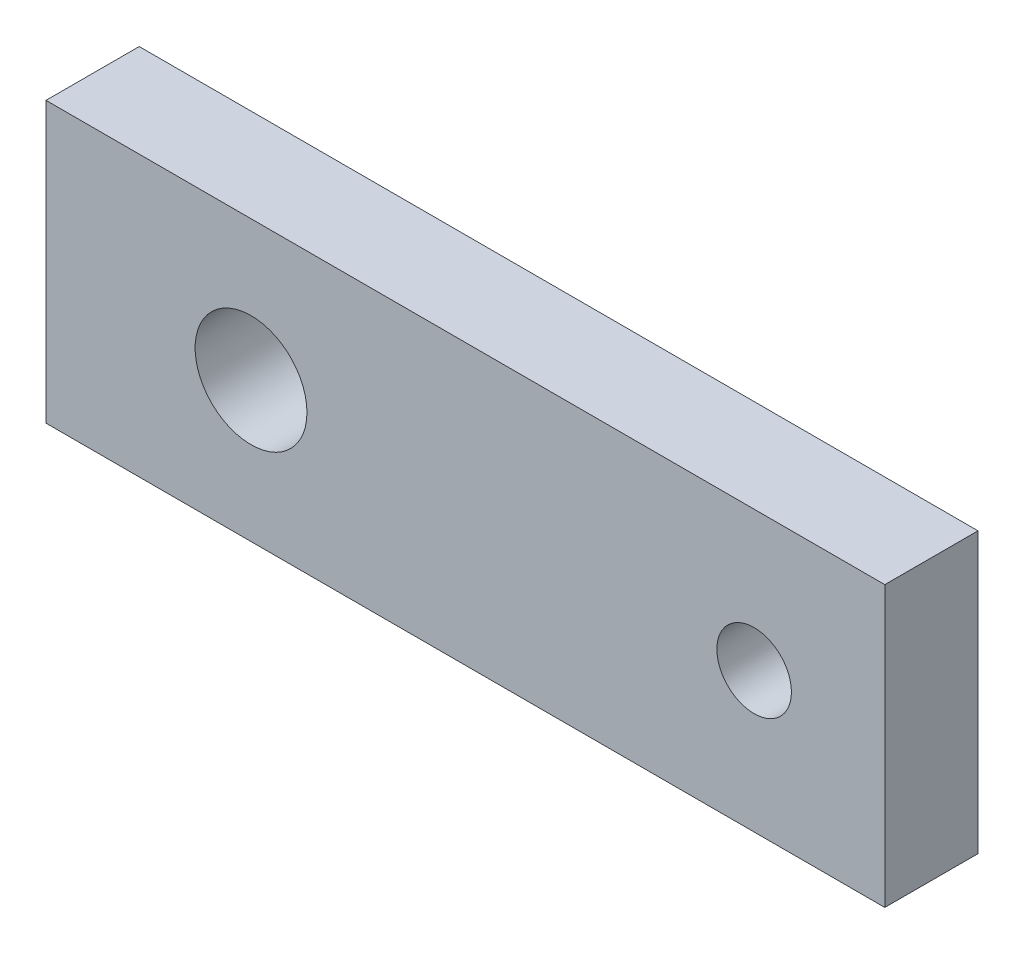
ISO-10303-21;
HEADER;
FILE_DESCRIPTION(('STEP AP214'),'2;1');
FILE_NAME('part.step','',(''),(''),'','','');
FILE_SCHEMA(('AUTOMOTIVE_DESIGN { 1 0 10303 214 1 1 1 1 }'));
ENDSEC;
DATA;
#1=APPLICATION_CONTEXT('core data for automotive mechanical design processes');
#2=APPLICATION_PROTOCOL_DEFINITION('international standard','automotive_design',2000,#1);
#3=PRODUCT_CONTEXT('',#1,'mechanical');
#4=PRODUCT('Part','Part','',(#3));
#5=PRODUCT_RELATED_PRODUCT_CATEGORY('part','',(#4));
#6=PRODUCT_DEFINITION_FORMATION('','',#4);
#7=PRODUCT_DEFINITION_CONTEXT('part definition',#1,'design');
#8=PRODUCT_DEFINITION('design','',#6,#7);
#9=PRODUCT_DEFINITION_SHAPE('','',#8);
#10=(LENGTH_UNIT() NAMED_UNIT(*) SI_UNIT(.MILLI.,.METRE.));
#11=(NAMED_UNIT(*) PLANE_ANGLE_UNIT() SI_UNIT($,.RADIAN.));
#12=(NAMED_UNIT(*) SI_UNIT($,.STERADIAN.) SOLID_ANGLE_UNIT());
#13=UNCERTAINTY_MEASURE_WITH_UNIT(LENGTH_MEASURE(1.E-05),#10,'distance_accuracy_value','');
#14=(GEOMETRIC_REPRESENTATION_CONTEXT(3) GLOBAL_UNCERTAINTY_ASSIGNED_CONTEXT((#13)) GLOBAL_UNIT_ASSIGNED_CONTEXT((#10,
#11,#12)) REPRESENTATION_CONTEXT('',''));
#15=CARTESIAN_POINT('',(0.,0.,0.));
#16=DIRECTION('',(0.,0.,1.));
#17=DIRECTION('',(1.,0.,0.));
#18=AXIS2_PLACEMENT_3D('',#15,#16,#17);
#19=CARTESIAN_POINT('',(0.,0.,10.));
#20=DIRECTION('',(0.,0.,-1.));
#21=DIRECTION('',(-1.,0.,0.));
#22=AXIS2_PLACEMENT_3D('',#19,#20,#21);
#23=PLANE('',#22);
#24=DIRECTION('',(0.,1.,0.));
#25=VECTOR('',#24,1.);
#26=CARTESIAN_POINT('',(45.,-15.,10.));
#27=LINE('',#26,#25);
#28=CARTESIAN_POINT('',(45.,-15.,10.));
#29=VERTEX_POINT('',#28);
#30=CARTESIAN_POINT('',(45.,15.,10.));
#31=VERTEX_POINT('',#30);
#32=EDGE_CURVE('E85',#29,#31,#27,.T.);
#33=ORIENTED_EDGE('',*,*,#32,.T.);
#34=DIRECTION('',(-1.,0.,0.));
#35=VECTOR('',#34,1.);
#36=CARTESIAN_POINT('',(-45.,15.,10.));
#37=LINE('',#36,#35);
#38=CARTESIAN_POINT('',(-45.,15.,10.));
#39=VERTEX_POINT('',#38);
#40=EDGE_CURVE('E80',#31,#39,#37,.T.);
#41=ORIENTED_EDGE('',*,*,#40,.T.);
#42=DIRECTION('',(0.,-1.,0.));
#43=VECTOR('',#42,1.);
#44=CARTESIAN_POINT('',(-45.,-15.,10.));
#45=LINE('',#44,#43);
#46=CARTESIAN_POINT('',(-45.,-15.,10.));
#47=VERTEX_POINT('',#46);
#48=EDGE_CURVE('E83',#39,#47,#45,.T.);
#49=ORIENTED_EDGE('',*,*,#48,.T.);
#50=DIRECTION('',(1.,0.,0.));
#51=VECTOR('',#50,1.);
#52=CARTESIAN_POINT('',(-45.,-15.,10.));
#53=LINE('',#52,#51);
#54=EDGE_CURVE('E50',#47,#29,#53,.T.);
#55=ORIENTED_EDGE('',*,*,#54,.T.);
#56=EDGE_LOOP('',(#33,#41,#49,#55));
#57=FACE_BOUND('',#56,.T.);
#58=CARTESIAN_POINT('',(-23.,0.,10.));
#59=DIRECTION('',(0.,0.,1.));
#60=DIRECTION('',(1.,0.,0.));
#61=AXIS2_PLACEMENT_3D('',#58,#59,#60);
#62=CIRCLE('',#61,6.);
#63=CARTESIAN_POINT('',(-17.,0.,10.));
#64=VERTEX_POINT('',#63);
#65=EDGE_CURVE('E100',#64,#64,#62,.T.);
#66=ORIENTED_EDGE('',*,*,#65,.F.);
#67=EDGE_LOOP('',(#66));
#68=FACE_BOUND('',#67,.T.);
#69=CARTESIAN_POINT('',(30.98,0.,10.));
#70=DIRECTION('',(0.,0.,1.));
#71=DIRECTION('',(1.,0.,0.));
#72=AXIS2_PLACEMENT_3D('',#69,#70,#71);
#73=CIRCLE('',#72,4.00000000000001);
#74=CARTESIAN_POINT('',(34.98,0.,10.));
#75=VERTEX_POINT('',#74);
#76=EDGE_CURVE('E115',#75,#75,#73,.T.);
#77=ORIENTED_EDGE('',*,*,#76,.F.);
#78=EDGE_LOOP('',(#77));
#79=FACE_BOUND('',#78,.T.);
#80=ADVANCED_FACE('F33',(#57,#68,#79),#23,.F.);
#81=CARTESIAN_POINT('',(0.,0.,0.));
#82=DIRECTION('',(0.,0.,-1.));
#83=DIRECTION('',(-1.,0.,0.));
#84=AXIS2_PLACEMENT_3D('',#81,#82,#83);
#85=PLANE('',#84);
#86=CARTESIAN_POINT('',(-23.,0.,0.));
#87=DIRECTION('',(0.,0.,1.));
#88=DIRECTION('',(1.,0.,0.));
#89=AXIS2_PLACEMENT_3D('',#86,#87,#88);
#90=CIRCLE('',#89,6.);
#91=CARTESIAN_POINT('',(-17.,0.,0.));
#92=VERTEX_POINT('',#91);
#93=EDGE_CURVE('E112',#92,#92,#90,.T.);
#94=ORIENTED_EDGE('',*,*,#93,.T.);
#95=EDGE_LOOP('',(#94));
#96=FACE_BOUND('',#95,.T.);
#97=DIRECTION('',(0.,1.,0.));
#98=VECTOR('',#97,1.);
#99=CARTESIAN_POINT('',(45.,-15.,0.));
#100=LINE('',#99,#98);
#101=CARTESIAN_POINT('',(45.,-15.,0.));
#102=VERTEX_POINT('',#101);
#103=CARTESIAN_POINT('',(45.,15.,0.));
#104=VERTEX_POINT('',#103);
#105=EDGE_CURVE('E97',#102,#104,#100,.T.);
#106=ORIENTED_EDGE('',*,*,#105,.F.);
#107=DIRECTION('',(1.,0.,0.));
#108=VECTOR('',#107,1.);
#109=CARTESIAN_POINT('',(-45.,-15.,0.));
#110=LINE('',#109,#108);
#111=CARTESIAN_POINT('',(-45.,-15.,0.));
#112=VERTEX_POINT('',#111);
#113=EDGE_CURVE('E73',#112,#102,#110,.T.);
#114=ORIENTED_EDGE('',*,*,#113,.F.);
#115=DIRECTION('',(0.,-1.,0.));
#116=VECTOR('',#115,1.);
#117=CARTESIAN_POINT('',(-45.,-15.,0.));
#118=LINE('',#117,#116);
#119=CARTESIAN_POINT('',(-45.,15.,0.));
#120=VERTEX_POINT('',#119);
#121=EDGE_CURVE('E67',#120,#112,#118,.T.);
#122=ORIENTED_EDGE('',*,*,#121,.F.);
#123=DIRECTION('',(-1.,0.,0.));
#124=VECTOR('',#123,1.);
#125=CARTESIAN_POINT('',(-45.,15.,0.));
#126=LINE('',#125,#124);
#127=EDGE_CURVE('E89',#104,#120,#126,.T.);
#128=ORIENTED_EDGE('',*,*,#127,.F.);
#129=EDGE_LOOP('',(#106,#114,#122,#128));
#130=FACE_BOUND('',#129,.T.);
#131=CARTESIAN_POINT('',(30.98,0.,0.));
#132=DIRECTION('',(0.,0.,1.));
#133=DIRECTION('',(1.,0.,0.));
#134=AXIS2_PLACEMENT_3D('',#131,#132,#133);
#135=CIRCLE('',#134,4.00000000000001);
#136=CARTESIAN_POINT('',(34.98,0.,0.));
#137=VERTEX_POINT('',#136);
#138=EDGE_CURVE('E118',#137,#137,#135,.T.);
#139=ORIENTED_EDGE('',*,*,#138,.T.);
#140=EDGE_LOOP('',(#139));
#141=FACE_BOUND('',#140,.T.);
#142=ADVANCED_FACE('F108',(#96,#130,#141),#85,.T.);
#143=CARTESIAN_POINT('',(45.,-15.,10.));
#144=DIRECTION('',(-1.,0.,0.));
#145=DIRECTION('',(0.,0.,1.));
#146=AXIS2_PLACEMENT_3D('',#143,#144,#145);
#147=PLANE('',#146);
#148=ORIENTED_EDGE('',*,*,#105,.T.);
#149=DIRECTION('',(0.,0.,-1.));
#150=VECTOR('',#149,1.);
#151=CARTESIAN_POINT('',(45.,15.,10.));
#152=LINE('',#151,#150);
#153=EDGE_CURVE('E11',#31,#104,#152,.T.);
#154=ORIENTED_EDGE('',*,*,#153,.F.);
#155=ORIENTED_EDGE('',*,*,#32,.F.);
#156=DIRECTION('',(0.,0.,-1.));
#157=VECTOR('',#156,1.);
#158=CARTESIAN_POINT('',(45.,-15.,10.));
#159=LINE('',#158,#157);
#160=EDGE_CURVE('E93',#29,#102,#159,.T.);
#161=ORIENTED_EDGE('',*,*,#160,.T.);
#162=EDGE_LOOP('',(#148,#154,#155,#161));
#163=FACE_BOUND('',#162,.T.);
#164=ADVANCED_FACE('F35',(#163),#147,.F.);
#165=CARTESIAN_POINT('',(-45.,15.,10.));
#166=DIRECTION('',(0.,-1.,0.));
#167=DIRECTION('',(0.,0.,-1.));
#168=AXIS2_PLACEMENT_3D('',#165,#166,#167);
#169=PLANE('',#168);
#170=ORIENTED_EDGE('',*,*,#127,.T.);
#171=DIRECTION('',(0.,0.,-1.));
#172=VECTOR('',#171,1.);
#173=CARTESIAN_POINT('',(-45.,15.,10.));
#174=LINE('',#173,#172);
#175=EDGE_CURVE('E42',#39,#120,#174,.T.);
#176=ORIENTED_EDGE('',*,*,#175,.F.);
#177=ORIENTED_EDGE('',*,*,#40,.F.);
#178=ORIENTED_EDGE('',*,*,#153,.T.);
#179=EDGE_LOOP('',(#170,#176,#177,#178));
#180=FACE_BOUND('',#179,.T.);
#181=ADVANCED_FACE('F88',(#180),#169,.F.);
#182=CARTESIAN_POINT('',(-45.,-15.,10.));
#183=DIRECTION('',(1.,0.,0.));
#184=DIRECTION('',(0.,0.,-1.));
#185=AXIS2_PLACEMENT_3D('',#182,#183,#184);
#186=PLANE('',#185);
#187=ORIENTED_EDGE('',*,*,#121,.T.);
#188=DIRECTION('',(0.,0.,-1.));
#189=VECTOR('',#188,1.);
#190=CARTESIAN_POINT('',(-45.,-15.,10.));
#191=LINE('',#190,#189);
#192=EDGE_CURVE('E90',#47,#112,#191,.T.);
#193=ORIENTED_EDGE('',*,*,#192,.F.);
#194=ORIENTED_EDGE('',*,*,#48,.F.);
#195=ORIENTED_EDGE('',*,*,#175,.T.);
#196=EDGE_LOOP('',(#187,#193,#194,#195));
#197=FACE_BOUND('',#196,.T.);
#198=ADVANCED_FACE('F91',(#197),#186,.F.);
#199=CARTESIAN_POINT('',(-45.,-15.,10.));
#200=DIRECTION('',(0.,1.,0.));
#201=DIRECTION('',(0.,0.,1.));
#202=AXIS2_PLACEMENT_3D('',#199,#200,#201);
#203=PLANE('',#202);
#204=ORIENTED_EDGE('',*,*,#113,.T.);
#205=ORIENTED_EDGE('',*,*,#160,.F.);
#206=ORIENTED_EDGE('',*,*,#54,.F.);
#207=ORIENTED_EDGE('',*,*,#192,.T.);
#208=EDGE_LOOP('',(#204,#205,#206,#207));
#209=FACE_BOUND('',#208,.T.);
#210=ADVANCED_FACE('F105',(#209),#203,.F.);
#211=CARTESIAN_POINT('',(-23.,0.,10.));
#212=DIRECTION('',(0.,0.,-1.));
#213=DIRECTION('',(-1.,0.,0.));
#214=AXIS2_PLACEMENT_3D('',#211,#212,#213);
#215=CYLINDRICAL_SURFACE('',#214,6.);
#216=ORIENTED_EDGE('',*,*,#65,.T.);
#217=EDGE_LOOP('',(#216));
#218=FACE_BOUND('',#217,.T.);
#219=ORIENTED_EDGE('',*,*,#93,.F.);
#220=EDGE_LOOP('',(#219));
#221=FACE_BOUND('',#220,.T.);
#222=ADVANCED_FACE('F135',(#218,#221),#215,.F.);
#223=CARTESIAN_POINT('',(30.98,0.,10.));
#224=DIRECTION('',(0.,0.,-1.));
#225=DIRECTION('',(-1.,0.,0.));
#226=AXIS2_PLACEMENT_3D('',#223,#224,#225);
#227=CYLINDRICAL_SURFACE('',#226,4.00000000000001);
#228=ORIENTED_EDGE('',*,*,#76,.T.);
#229=EDGE_LOOP('',(#228));
#230=FACE_BOUND('',#229,.T.);
#231=ORIENTED_EDGE('',*,*,#138,.F.);
#232=EDGE_LOOP('',(#231));
#233=FACE_BOUND('',#232,.T.);
#234=ADVANCED_FACE('F124',(#230,#233),#227,.F.);
#235=CLOSED_SHELL('',(#80,#142,#164,#181,#198,#210,#222,#234));
#236=MANIFOLD_SOLID_BREP('B2',#235);
#237=ADVANCED_BREP_SHAPE_REPRESENTATION('',(#18,#236),#14);
#238=SHAPE_DEFINITION_REPRESENTATION(#9,#237);
ENDSEC;
END-ISO-10303-21;
